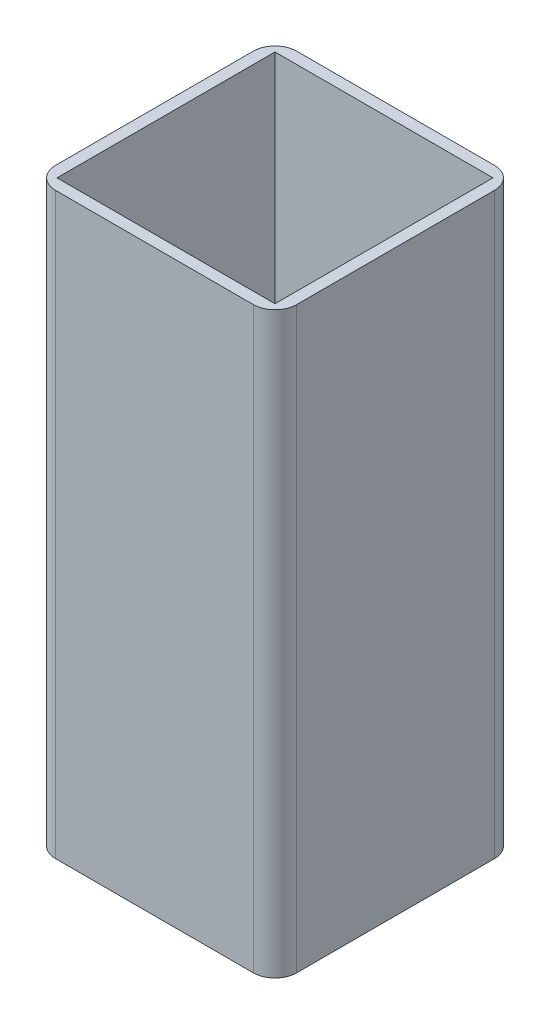
ISO-10303-21;
HEADER;
FILE_DESCRIPTION(('STEP AP214'),'2;1');
FILE_NAME('part.step','',(''),(''),'','','');
FILE_SCHEMA(('AUTOMOTIVE_DESIGN { 1 0 10303 214 1 1 1 1 }'));
ENDSEC;
DATA;
#1=APPLICATION_CONTEXT('core data for automotive mechanical design processes');
#2=APPLICATION_PROTOCOL_DEFINITION('international standard','automotive_design',2000,#1);
#3=PRODUCT_CONTEXT('',#1,'mechanical');
#4=PRODUCT('Part','Part','',(#3));
#5=PRODUCT_RELATED_PRODUCT_CATEGORY('part','',(#4));
#6=PRODUCT_DEFINITION_FORMATION('','',#4);
#7=PRODUCT_DEFINITION_CONTEXT('part definition',#1,'design');
#8=PRODUCT_DEFINITION('design','',#6,#7);
#9=PRODUCT_DEFINITION_SHAPE('','',#8);
#10=(LENGTH_UNIT() NAMED_UNIT(*) SI_UNIT(.MILLI.,.METRE.));
#11=(NAMED_UNIT(*) PLANE_ANGLE_UNIT() SI_UNIT($,.RADIAN.));
#12=(NAMED_UNIT(*) SI_UNIT($,.STERADIAN.) SOLID_ANGLE_UNIT());
#13=UNCERTAINTY_MEASURE_WITH_UNIT(LENGTH_MEASURE(1.E-05),#10,'distance_accuracy_value','');
#14=(GEOMETRIC_REPRESENTATION_CONTEXT(3) GLOBAL_UNCERTAINTY_ASSIGNED_CONTEXT((#13)) GLOBAL_UNIT_ASSIGNED_CONTEXT((#10,
#11,#12)) REPRESENTATION_CONTEXT('',''));
#15=CARTESIAN_POINT('',(0.,0.,0.));
#16=DIRECTION('',(0.,0.,1.));
#17=DIRECTION('',(1.,0.,0.));
#18=AXIS2_PLACEMENT_3D('',#15,#16,#17);
#19=CARTESIAN_POINT('',(-108.333333333333,340.,108.333333333333));
#20=DIRECTION('',(0.,-1.,0.));
#21=DIRECTION('',(0.,0.,-1.));
#22=AXIS2_PLACEMENT_3D('',#19,#20,#21);
#23=PLANE('',#22);
#24=DIRECTION('',(-1.,0.,0.));
#25=VECTOR('',#24,1.);
#26=CARTESIAN_POINT('',(-108.333333333333,340.,-141.666666666667));
#27=LINE('',#26,#25);
#28=CARTESIAN_POINT('',(119.166666666667,340.,-141.666666666667));
#29=VERTEX_POINT('',#28);
#30=CARTESIAN_POINT('',(-85.8333333333333,340.,-141.666666666667));
#31=VERTEX_POINT('',#30);
#32=EDGE_CURVE('E179',#29,#31,#27,.T.);
#33=ORIENTED_EDGE('',*,*,#32,.T.);
#34=CARTESIAN_POINT('',(-85.8333333333333,340.,-119.166666666667));
#35=DIRECTION('',(0.,-1.,0.));
#36=DIRECTION('',(0.,0.,-1.));
#37=AXIS2_PLACEMENT_3D('',#34,#35,#36);
#38=CIRCLE('',#37,22.5);
#39=CARTESIAN_POINT('',(-108.333333333333,340.,-119.166666666667));
#40=VERTEX_POINT('',#39);
#41=EDGE_CURVE('E214',#31,#40,#38,.F.);
#42=ORIENTED_EDGE('',*,*,#41,.T.);
#43=DIRECTION('',(0.,0.,1.));
#44=VECTOR('',#43,1.);
#45=CARTESIAN_POINT('',(-108.333333333333,340.,108.333333333333));
#46=LINE('',#45,#44);
#47=CARTESIAN_POINT('',(-108.333333333333,340.,85.8333333333333));
#48=VERTEX_POINT('',#47);
#49=EDGE_CURVE('E171',#40,#48,#46,.T.);
#50=ORIENTED_EDGE('',*,*,#49,.T.);
#51=CARTESIAN_POINT('',(-85.8333333333333,340.,85.8333333333333));
#52=DIRECTION('',(0.,-1.,0.));
#53=DIRECTION('',(0.,0.,-1.));
#54=AXIS2_PLACEMENT_3D('',#51,#52,#53);
#55=CIRCLE('',#54,22.5);
#56=CARTESIAN_POINT('',(-85.8333333333333,340.,108.333333333333));
#57=VERTEX_POINT('',#56);
#58=EDGE_CURVE('E212',#48,#57,#55,.F.);
#59=ORIENTED_EDGE('',*,*,#58,.T.);
#60=DIRECTION('',(1.,0.,0.));
#61=VECTOR('',#60,1.);
#62=CARTESIAN_POINT('',(-108.333333333333,340.,108.333333333333));
#63=LINE('',#62,#61);
#64=CARTESIAN_POINT('',(119.166666666667,340.,108.333333333333));
#65=VERTEX_POINT('',#64);
#66=EDGE_CURVE('E174',#57,#65,#63,.T.);
#67=ORIENTED_EDGE('',*,*,#66,.T.);
#68=CARTESIAN_POINT('',(119.166666666667,340.,85.8333333333333));
#69=DIRECTION('',(0.,-1.,0.));
#70=DIRECTION('',(0.,0.,-1.));
#71=AXIS2_PLACEMENT_3D('',#68,#69,#70);
#72=CIRCLE('',#71,22.5);
#73=CARTESIAN_POINT('',(141.666666666667,340.,85.8333333333333));
#74=VERTEX_POINT('',#73);
#75=EDGE_CURVE('E60',#65,#74,#72,.F.);
#76=ORIENTED_EDGE('',*,*,#75,.T.);
#77=DIRECTION('',(0.,0.,-1.));
#78=VECTOR('',#77,1.);
#79=CARTESIAN_POINT('',(141.666666666667,340.,108.333333333333));
#80=LINE('',#79,#78);
#81=CARTESIAN_POINT('',(141.666666666667,340.,-119.166666666667));
#82=VERTEX_POINT('',#81);
#83=EDGE_CURVE('E177',#74,#82,#80,.T.);
#84=ORIENTED_EDGE('',*,*,#83,.T.);
#85=CARTESIAN_POINT('',(119.166666666667,340.,-119.166666666667));
#86=DIRECTION('',(0.,-1.,0.));
#87=DIRECTION('',(0.,0.,-1.));
#88=AXIS2_PLACEMENT_3D('',#85,#86,#87);
#89=CIRCLE('',#88,22.5);
#90=EDGE_CURVE('E209',#82,#29,#89,.F.);
#91=ORIENTED_EDGE('',*,*,#90,.T.);
#92=EDGE_LOOP('',(#33,#42,#50,#59,#67,#76,#84,#91));
#93=FACE_BOUND('',#92,.T.);
#94=DIRECTION('',(0.,0.,1.));
#95=VECTOR('',#94,1.);
#96=CARTESIAN_POINT('',(-96.3333333333333,340.,96.3333333333333));
#97=LINE('',#96,#95);
#98=CARTESIAN_POINT('',(-96.3333333333333,340.,-129.666666666667));
#99=VERTEX_POINT('',#98);
#100=CARTESIAN_POINT('',(-96.3333333333333,340.,96.3333333333333));
#101=VERTEX_POINT('',#100);
#102=EDGE_CURVE('E130',#99,#101,#97,.T.);
#103=ORIENTED_EDGE('',*,*,#102,.F.);
#104=DIRECTION('',(-1.,0.,0.));
#105=VECTOR('',#104,1.);
#106=CARTESIAN_POINT('',(-96.3333333333333,340.,-129.666666666667));
#107=LINE('',#106,#105);
#108=CARTESIAN_POINT('',(129.666666666667,340.,-129.666666666667));
#109=VERTEX_POINT('',#108);
#110=EDGE_CURVE('E155',#109,#99,#107,.T.);
#111=ORIENTED_EDGE('',*,*,#110,.F.);
#112=DIRECTION('',(0.,0.,-1.));
#113=VECTOR('',#112,1.);
#114=CARTESIAN_POINT('',(129.666666666667,340.,96.3333333333333));
#115=LINE('',#114,#113);
#116=CARTESIAN_POINT('',(129.666666666667,340.,96.3333333333333));
#117=VERTEX_POINT('',#116);
#118=EDGE_CURVE('E153',#117,#109,#115,.T.);
#119=ORIENTED_EDGE('',*,*,#118,.F.);
#120=DIRECTION('',(1.,0.,0.));
#121=VECTOR('',#120,1.);
#122=CARTESIAN_POINT('',(-96.3333333333333,340.,96.3333333333333));
#123=LINE('',#122,#121);
#124=EDGE_CURVE('E140',#101,#117,#123,.T.);
#125=ORIENTED_EDGE('',*,*,#124,.F.);
#126=EDGE_LOOP('',(#103,#111,#119,#125));
#127=FACE_BOUND('',#126,.T.);
#128=ADVANCED_FACE('F39',(#93,#127),#23,.F.);
#129=CARTESIAN_POINT('',(-108.333333333333,-260.,108.333333333333));
#130=DIRECTION('',(0.,-1.,0.));
#131=DIRECTION('',(0.,0.,-1.));
#132=AXIS2_PLACEMENT_3D('',#129,#130,#131);
#133=PLANE('',#132);
#134=DIRECTION('',(0.,0.,1.));
#135=VECTOR('',#134,1.);
#136=CARTESIAN_POINT('',(-108.333333333333,-260.,108.333333333333));
#137=LINE('',#136,#135);
#138=CARTESIAN_POINT('',(-108.333333333333,-260.,-119.166666666667));
#139=VERTEX_POINT('',#138);
#140=CARTESIAN_POINT('',(-108.333333333333,-260.,85.8333333333333));
#141=VERTEX_POINT('',#140);
#142=EDGE_CURVE('E148',#139,#141,#137,.T.);
#143=ORIENTED_EDGE('',*,*,#142,.F.);
#144=CARTESIAN_POINT('',(-85.8333333333333,-260.,-119.166666666667));
#145=DIRECTION('',(0.,-1.,0.));
#146=DIRECTION('',(0.,0.,-1.));
#147=AXIS2_PLACEMENT_3D('',#144,#145,#146);
#148=CIRCLE('',#147,22.5);
#149=CARTESIAN_POINT('',(-85.8333333333333,-260.,-141.666666666667));
#150=VERTEX_POINT('',#149);
#151=EDGE_CURVE('E202',#139,#150,#148,.T.);
#152=ORIENTED_EDGE('',*,*,#151,.T.);
#153=DIRECTION('',(-1.,0.,0.));
#154=VECTOR('',#153,1.);
#155=CARTESIAN_POINT('',(-108.333333333333,-260.,-141.666666666667));
#156=LINE('',#155,#154);
#157=CARTESIAN_POINT('',(119.166666666667,-260.,-141.666666666667));
#158=VERTEX_POINT('',#157);
#159=EDGE_CURVE('E175',#158,#150,#156,.T.);
#160=ORIENTED_EDGE('',*,*,#159,.F.);
#161=CARTESIAN_POINT('',(119.166666666667,-260.,-119.166666666667));
#162=DIRECTION('',(0.,-1.,0.));
#163=DIRECTION('',(0.,0.,-1.));
#164=AXIS2_PLACEMENT_3D('',#161,#162,#163);
#165=CIRCLE('',#164,22.5);
#166=CARTESIAN_POINT('',(141.666666666667,-260.,-119.166666666667));
#167=VERTEX_POINT('',#166);
#168=EDGE_CURVE('E196',#158,#167,#165,.T.);
#169=ORIENTED_EDGE('',*,*,#168,.T.);
#170=DIRECTION('',(0.,0.,-1.));
#171=VECTOR('',#170,1.);
#172=CARTESIAN_POINT('',(141.666666666667,-260.,108.333333333333));
#173=LINE('',#172,#171);
#174=CARTESIAN_POINT('',(141.666666666667,-260.,85.8333333333333));
#175=VERTEX_POINT('',#174);
#176=EDGE_CURVE('E188',#175,#167,#173,.T.);
#177=ORIENTED_EDGE('',*,*,#176,.F.);
#178=CARTESIAN_POINT('',(119.166666666667,-260.,85.8333333333333));
#179=DIRECTION('',(0.,-1.,0.));
#180=DIRECTION('',(0.,0.,-1.));
#181=AXIS2_PLACEMENT_3D('',#178,#179,#180);
#182=CIRCLE('',#181,22.5);
#183=CARTESIAN_POINT('',(119.166666666667,-260.,108.333333333333));
#184=VERTEX_POINT('',#183);
#185=EDGE_CURVE('E198',#175,#184,#182,.T.);
#186=ORIENTED_EDGE('',*,*,#185,.T.);
#187=DIRECTION('',(1.,0.,0.));
#188=VECTOR('',#187,1.);
#189=CARTESIAN_POINT('',(-108.333333333333,-260.,108.333333333333));
#190=LINE('',#189,#188);
#191=CARTESIAN_POINT('',(-85.8333333333333,-260.,108.333333333333));
#192=VERTEX_POINT('',#191);
#193=EDGE_CURVE('E185',#192,#184,#190,.T.);
#194=ORIENTED_EDGE('',*,*,#193,.F.);
#195=CARTESIAN_POINT('',(-85.8333333333333,-260.,85.8333333333333));
#196=DIRECTION('',(0.,-1.,0.));
#197=DIRECTION('',(0.,0.,-1.));
#198=AXIS2_PLACEMENT_3D('',#195,#196,#197);
#199=CIRCLE('',#198,22.5);
#200=EDGE_CURVE('E200',#192,#141,#199,.T.);
#201=ORIENTED_EDGE('',*,*,#200,.T.);
#202=EDGE_LOOP('',(#143,#152,#160,#169,#177,#186,#194,#201));
#203=FACE_BOUND('',#202,.T.);
#204=DIRECTION('',(-1.,0.,0.));
#205=VECTOR('',#204,1.);
#206=CARTESIAN_POINT('',(-96.3333333333333,-260.,-129.666666666667));
#207=LINE('',#206,#205);
#208=CARTESIAN_POINT('',(129.666666666667,-260.,-129.666666666667));
#209=VERTEX_POINT('',#208);
#210=CARTESIAN_POINT('',(-96.3333333333333,-260.,-129.666666666667));
#211=VERTEX_POINT('',#210);
#212=EDGE_CURVE('E141',#209,#211,#207,.T.);
#213=ORIENTED_EDGE('',*,*,#212,.T.);
#214=DIRECTION('',(0.,0.,1.));
#215=VECTOR('',#214,1.);
#216=CARTESIAN_POINT('',(-96.3333333333333,-260.,96.3333333333333));
#217=LINE('',#216,#215);
#218=CARTESIAN_POINT('',(-96.3333333333333,-260.,96.3333333333333));
#219=VERTEX_POINT('',#218);
#220=EDGE_CURVE('E159',#211,#219,#217,.T.);
#221=ORIENTED_EDGE('',*,*,#220,.T.);
#222=DIRECTION('',(1.,0.,0.));
#223=VECTOR('',#222,1.);
#224=CARTESIAN_POINT('',(-96.3333333333333,-260.,96.3333333333333));
#225=LINE('',#224,#223);
#226=CARTESIAN_POINT('',(129.666666666667,-260.,96.3333333333333));
#227=VERTEX_POINT('',#226);
#228=EDGE_CURVE('E147',#219,#227,#225,.T.);
#229=ORIENTED_EDGE('',*,*,#228,.T.);
#230=DIRECTION('',(0.,0.,-1.));
#231=VECTOR('',#230,1.);
#232=CARTESIAN_POINT('',(129.666666666667,-260.,96.3333333333333));
#233=LINE('',#232,#231);
#234=EDGE_CURVE('E162',#227,#209,#233,.T.);
#235=ORIENTED_EDGE('',*,*,#234,.T.);
#236=EDGE_LOOP('',(#213,#221,#229,#235));
#237=FACE_BOUND('',#236,.T.);
#238=ADVANCED_FACE('F230',(#203,#237),#133,.T.);
#239=CARTESIAN_POINT('',(-108.333333333333,340.,108.333333333333));
#240=DIRECTION('',(1.,0.,0.));
#241=DIRECTION('',(0.,0.,-1.));
#242=AXIS2_PLACEMENT_3D('',#239,#240,#241);
#243=PLANE('',#242);
#244=ORIENTED_EDGE('',*,*,#49,.F.);
#245=DIRECTION('',(0.,-1.,0.));
#246=VECTOR('',#245,1.);
#247=CARTESIAN_POINT('',(-108.333333333333,340.,-119.166666666667));
#248=LINE('',#247,#246);
#249=EDGE_CURVE('E193',#40,#139,#248,.T.);
#250=ORIENTED_EDGE('',*,*,#249,.T.);
#251=ORIENTED_EDGE('',*,*,#142,.T.);
#252=DIRECTION('',(0.,-1.,0.));
#253=VECTOR('',#252,1.);
#254=CARTESIAN_POINT('',(-108.333333333333,340.,85.8333333333333));
#255=LINE('',#254,#253);
#256=EDGE_CURVE('E182',#141,#48,#255,.F.);
#257=ORIENTED_EDGE('',*,*,#256,.T.);
#258=EDGE_LOOP('',(#244,#250,#251,#257));
#259=FACE_BOUND('',#258,.T.);
#260=ADVANCED_FACE('F251',(#259),#243,.F.);
#261=CARTESIAN_POINT('',(-108.333333333333,340.,108.333333333333));
#262=DIRECTION('',(0.,0.,-1.));
#263=DIRECTION('',(-1.,0.,0.));
#264=AXIS2_PLACEMENT_3D('',#261,#262,#263);
#265=PLANE('',#264);
#266=ORIENTED_EDGE('',*,*,#66,.F.);
#267=DIRECTION('',(0.,-1.,0.));
#268=VECTOR('',#267,1.);
#269=CARTESIAN_POINT('',(-85.8333333333333,340.,108.333333333333));
#270=LINE('',#269,#268);
#271=EDGE_CURVE('E218',#57,#192,#270,.T.);
#272=ORIENTED_EDGE('',*,*,#271,.T.);
#273=ORIENTED_EDGE('',*,*,#193,.T.);
#274=DIRECTION('',(0.,-1.,0.));
#275=VECTOR('',#274,1.);
#276=CARTESIAN_POINT('',(119.166666666667,340.,108.333333333333));
#277=LINE('',#276,#275);
#278=EDGE_CURVE('E216',#184,#65,#277,.F.);
#279=ORIENTED_EDGE('',*,*,#278,.T.);
#280=EDGE_LOOP('',(#266,#272,#273,#279));
#281=FACE_BOUND('',#280,.T.);
#282=ADVANCED_FACE('F224',(#281),#265,.F.);
#283=CARTESIAN_POINT('',(141.666666666667,340.,108.333333333333));
#284=DIRECTION('',(-1.,0.,0.));
#285=DIRECTION('',(0.,0.,1.));
#286=AXIS2_PLACEMENT_3D('',#283,#284,#285);
#287=PLANE('',#286);
#288=ORIENTED_EDGE('',*,*,#83,.F.);
#289=DIRECTION('',(0.,-1.,0.));
#290=VECTOR('',#289,1.);
#291=CARTESIAN_POINT('',(141.666666666667,340.,85.8333333333333));
#292=LINE('',#291,#290);
#293=EDGE_CURVE('E11',#74,#175,#292,.T.);
#294=ORIENTED_EDGE('',*,*,#293,.T.);
#295=ORIENTED_EDGE('',*,*,#176,.T.);
#296=DIRECTION('',(0.,-1.,0.));
#297=VECTOR('',#296,1.);
#298=CARTESIAN_POINT('',(141.666666666667,340.,-119.166666666667));
#299=LINE('',#298,#297);
#300=EDGE_CURVE('E47',#167,#82,#299,.F.);
#301=ORIENTED_EDGE('',*,*,#300,.T.);
#302=EDGE_LOOP('',(#288,#294,#295,#301));
#303=FACE_BOUND('',#302,.T.);
#304=ADVANCED_FACE('F236',(#303),#287,.F.);
#305=CARTESIAN_POINT('',(-108.333333333333,340.,-141.666666666667));
#306=DIRECTION('',(0.,0.,1.));
#307=DIRECTION('',(1.,0.,0.));
#308=AXIS2_PLACEMENT_3D('',#305,#306,#307);
#309=PLANE('',#308);
#310=ORIENTED_EDGE('',*,*,#159,.T.);
#311=DIRECTION('',(0.,-1.,0.));
#312=VECTOR('',#311,1.);
#313=CARTESIAN_POINT('',(-85.8333333333333,340.,-141.666666666667));
#314=LINE('',#313,#312);
#315=EDGE_CURVE('E207',#150,#31,#314,.F.);
#316=ORIENTED_EDGE('',*,*,#315,.T.);
#317=ORIENTED_EDGE('',*,*,#32,.F.);
#318=DIRECTION('',(0.,-1.,0.));
#319=VECTOR('',#318,1.);
#320=CARTESIAN_POINT('',(119.166666666667,340.,-141.666666666667));
#321=LINE('',#320,#319);
#322=EDGE_CURVE('E204',#29,#158,#321,.T.);
#323=ORIENTED_EDGE('',*,*,#322,.T.);
#324=EDGE_LOOP('',(#310,#316,#317,#323));
#325=FACE_BOUND('',#324,.T.);
#326=ADVANCED_FACE('F243',(#325),#309,.F.);
#327=CARTESIAN_POINT('',(-96.3333333333333,340.,96.3333333333333));
#328=DIRECTION('',(1.,0.,0.));
#329=DIRECTION('',(0.,0.,-1.));
#330=AXIS2_PLACEMENT_3D('',#327,#328,#329);
#331=PLANE('',#330);
#332=ORIENTED_EDGE('',*,*,#220,.F.);
#333=DIRECTION('',(0.,-1.,0.));
#334=VECTOR('',#333,1.);
#335=CARTESIAN_POINT('',(-96.3333333333333,340.,-129.666666666667));
#336=LINE('',#335,#334);
#337=EDGE_CURVE('E136',#99,#211,#336,.T.);
#338=ORIENTED_EDGE('',*,*,#337,.F.);
#339=ORIENTED_EDGE('',*,*,#102,.T.);
#340=DIRECTION('',(0.,-1.,0.));
#341=VECTOR('',#340,1.);
#342=CARTESIAN_POINT('',(-96.3333333333333,340.,96.3333333333333));
#343=LINE('',#342,#341);
#344=EDGE_CURVE('E133',#101,#219,#343,.T.);
#345=ORIENTED_EDGE('',*,*,#344,.T.);
#346=EDGE_LOOP('',(#332,#338,#339,#345));
#347=FACE_BOUND('',#346,.T.);
#348=ADVANCED_FACE('F132',(#347),#331,.T.);
#349=CARTESIAN_POINT('',(-96.3333333333333,340.,96.3333333333333));
#350=DIRECTION('',(0.,0.,-1.));
#351=DIRECTION('',(-1.,0.,0.));
#352=AXIS2_PLACEMENT_3D('',#349,#350,#351);
#353=PLANE('',#352);
#354=ORIENTED_EDGE('',*,*,#228,.F.);
#355=ORIENTED_EDGE('',*,*,#344,.F.);
#356=ORIENTED_EDGE('',*,*,#124,.T.);
#357=DIRECTION('',(0.,-1.,0.));
#358=VECTOR('',#357,1.);
#359=CARTESIAN_POINT('',(129.666666666667,340.,96.3333333333333));
#360=LINE('',#359,#358);
#361=EDGE_CURVE('E149',#117,#227,#360,.T.);
#362=ORIENTED_EDGE('',*,*,#361,.T.);
#363=EDGE_LOOP('',(#354,#355,#356,#362));
#364=FACE_BOUND('',#363,.T.);
#365=ADVANCED_FACE('F144',(#364),#353,.T.);
#366=CARTESIAN_POINT('',(129.666666666667,340.,96.3333333333333));
#367=DIRECTION('',(-1.,0.,0.));
#368=DIRECTION('',(0.,0.,1.));
#369=AXIS2_PLACEMENT_3D('',#366,#367,#368);
#370=PLANE('',#369);
#371=ORIENTED_EDGE('',*,*,#234,.F.);
#372=ORIENTED_EDGE('',*,*,#361,.F.);
#373=ORIENTED_EDGE('',*,*,#118,.T.);
#374=DIRECTION('',(0.,-1.,0.));
#375=VECTOR('',#374,1.);
#376=CARTESIAN_POINT('',(129.666666666667,340.,-129.666666666667));
#377=LINE('',#376,#375);
#378=EDGE_CURVE('E168',#109,#209,#377,.T.);
#379=ORIENTED_EDGE('',*,*,#378,.T.);
#380=EDGE_LOOP('',(#371,#372,#373,#379));
#381=FACE_BOUND('',#380,.T.);
#382=ADVANCED_FACE('F305',(#381),#370,.T.);
#383=CARTESIAN_POINT('',(-96.3333333333333,340.,-129.666666666667));
#384=DIRECTION('',(0.,0.,1.));
#385=DIRECTION('',(1.,0.,0.));
#386=AXIS2_PLACEMENT_3D('',#383,#384,#385);
#387=PLANE('',#386);
#388=ORIENTED_EDGE('',*,*,#212,.F.);
#389=ORIENTED_EDGE('',*,*,#378,.F.);
#390=ORIENTED_EDGE('',*,*,#110,.T.);
#391=ORIENTED_EDGE('',*,*,#337,.T.);
#392=EDGE_LOOP('',(#388,#389,#390,#391));
#393=FACE_BOUND('',#392,.T.);
#394=ADVANCED_FACE('F260',(#393),#387,.T.);
#395=CARTESIAN_POINT('',(-85.8333333333333,340.,-119.166666666667));
#396=DIRECTION('',(0.,-1.,0.));
#397=DIRECTION('',(0.,0.,-1.));
#398=AXIS2_PLACEMENT_3D('',#395,#396,#397);
#399=CYLINDRICAL_SURFACE('',#398,22.5);
#400=ORIENTED_EDGE('',*,*,#41,.F.);
#401=ORIENTED_EDGE('',*,*,#315,.F.);
#402=ORIENTED_EDGE('',*,*,#151,.F.);
#403=ORIENTED_EDGE('',*,*,#249,.F.);
#404=EDGE_LOOP('',(#400,#401,#402,#403));
#405=FACE_BOUND('',#404,.T.);
#406=ADVANCED_FACE('F248',(#405),#399,.T.);
#407=CARTESIAN_POINT('',(-85.8333333333333,340.,85.8333333333333));
#408=DIRECTION('',(0.,-1.,0.));
#409=DIRECTION('',(0.,0.,-1.));
#410=AXIS2_PLACEMENT_3D('',#407,#408,#409);
#411=CYLINDRICAL_SURFACE('',#410,22.5);
#412=ORIENTED_EDGE('',*,*,#58,.F.);
#413=ORIENTED_EDGE('',*,*,#256,.F.);
#414=ORIENTED_EDGE('',*,*,#200,.F.);
#415=ORIENTED_EDGE('',*,*,#271,.F.);
#416=EDGE_LOOP('',(#412,#413,#414,#415));
#417=FACE_BOUND('',#416,.T.);
#418=ADVANCED_FACE('F253',(#417),#411,.T.);
#419=CARTESIAN_POINT('',(119.166666666667,340.,85.8333333333333));
#420=DIRECTION('',(0.,-1.,0.));
#421=DIRECTION('',(0.,0.,-1.));
#422=AXIS2_PLACEMENT_3D('',#419,#420,#421);
#423=CYLINDRICAL_SURFACE('',#422,22.5);
#424=ORIENTED_EDGE('',*,*,#75,.F.);
#425=ORIENTED_EDGE('',*,*,#278,.F.);
#426=ORIENTED_EDGE('',*,*,#185,.F.);
#427=ORIENTED_EDGE('',*,*,#293,.F.);
#428=EDGE_LOOP('',(#424,#425,#426,#427));
#429=FACE_BOUND('',#428,.T.);
#430=ADVANCED_FACE('F235',(#429),#423,.T.);
#431=CARTESIAN_POINT('',(119.166666666667,340.,-119.166666666667));
#432=DIRECTION('',(0.,-1.,0.));
#433=DIRECTION('',(0.,0.,-1.));
#434=AXIS2_PLACEMENT_3D('',#431,#432,#433);
#435=CYLINDRICAL_SURFACE('',#434,22.5);
#436=ORIENTED_EDGE('',*,*,#90,.F.);
#437=ORIENTED_EDGE('',*,*,#300,.F.);
#438=ORIENTED_EDGE('',*,*,#168,.F.);
#439=ORIENTED_EDGE('',*,*,#322,.F.);
#440=EDGE_LOOP('',(#436,#437,#438,#439));
#441=FACE_BOUND('',#440,.T.);
#442=ADVANCED_FACE('F41',(#441),#435,.T.);
#443=CLOSED_SHELL('',(#128,#238,#260,#282,#304,#326,#348,#365,#382,#394,#406,#418,#430,#442));
#444=MANIFOLD_SOLID_BREP('B2',#443);
#445=ADVANCED_BREP_SHAPE_REPRESENTATION('',(#18,#444),#14);
#446=SHAPE_DEFINITION_REPRESENTATION(#9,#445);
ENDSEC;
END-ISO-10303-21;
